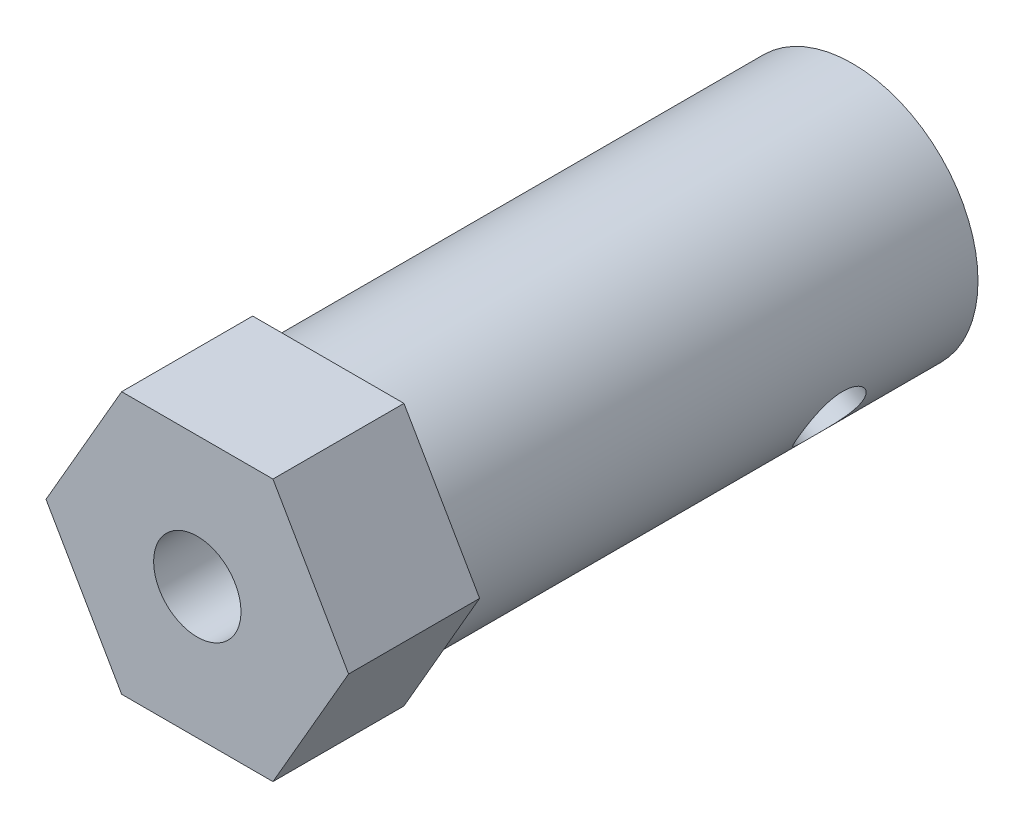
ISO-10303-21;
HEADER;
FILE_DESCRIPTION(('STEP AP214'),'2;1');
FILE_NAME('part.step','',(''),(''),'','','');
FILE_SCHEMA(('AUTOMOTIVE_DESIGN { 1 0 10303 214 1 1 1 1 }'));
ENDSEC;
DATA;
#1=APPLICATION_CONTEXT('core data for automotive mechanical design processes');
#2=APPLICATION_PROTOCOL_DEFINITION('international standard','automotive_design',2000,#1);
#3=PRODUCT_CONTEXT('',#1,'mechanical');
#4=PRODUCT('Part','Part','',(#3));
#5=PRODUCT_RELATED_PRODUCT_CATEGORY('part','',(#4));
#6=PRODUCT_DEFINITION_FORMATION('','',#4);
#7=PRODUCT_DEFINITION_CONTEXT('part definition',#1,'design');
#8=PRODUCT_DEFINITION('design','',#6,#7);
#9=PRODUCT_DEFINITION_SHAPE('','',#8);
#10=(LENGTH_UNIT() NAMED_UNIT(*) SI_UNIT(.MILLI.,.METRE.));
#11=(NAMED_UNIT(*) PLANE_ANGLE_UNIT() SI_UNIT($,.RADIAN.));
#12=(NAMED_UNIT(*) SI_UNIT($,.STERADIAN.) SOLID_ANGLE_UNIT());
#13=UNCERTAINTY_MEASURE_WITH_UNIT(LENGTH_MEASURE(1.E-05),#10,'distance_accuracy_value','');
#14=(GEOMETRIC_REPRESENTATION_CONTEXT(3) GLOBAL_UNCERTAINTY_ASSIGNED_CONTEXT((#13)) GLOBAL_UNIT_ASSIGNED_CONTEXT((#10,
#11,#12)) REPRESENTATION_CONTEXT('',''));
#15=CARTESIAN_POINT('',(0.,0.,0.));
#16=DIRECTION('',(0.,0.,1.));
#17=DIRECTION('',(1.,0.,0.));
#18=AXIS2_PLACEMENT_3D('',#15,#16,#17);
#19=CARTESIAN_POINT('',(-3.46410161513783,5.99999999999996,6.));
#20=DIRECTION('',(0.866025403784441,-0.499999999999995,0.));
#21=DIRECTION('',(0.499999999999995,0.866025403784442,0.));
#22=AXIS2_PLACEMENT_3D('',#19,#20,#21);
#23=PLANE('',#22);
#24=DIRECTION('',(-0.499999999999995,-0.866025403784441,0.));
#25=VECTOR('',#24,1.);
#26=CARTESIAN_POINT('',(-3.46410161513783,5.99999999999996,0.));
#27=LINE('',#26,#25);
#28=CARTESIAN_POINT('',(-3.46410161513783,5.99999999999996,0.));
#29=VERTEX_POINT('',#28);
#30=CARTESIAN_POINT('',(-6.92820323027551,0.,0.));
#31=VERTEX_POINT('',#30);
#32=EDGE_CURVE('E135',#29,#31,#27,.T.);
#33=ORIENTED_EDGE('',*,*,#32,.T.);
#34=DIRECTION('',(0.,0.,-1.));
#35=VECTOR('',#34,1.);
#36=CARTESIAN_POINT('',(-6.92820323027551,0.,6.));
#37=LINE('',#36,#35);
#38=CARTESIAN_POINT('',(-6.92820323027551,0.,6.));
#39=VERTEX_POINT('',#38);
#40=EDGE_CURVE('E57',#39,#31,#37,.T.);
#41=ORIENTED_EDGE('',*,*,#40,.F.);
#42=DIRECTION('',(-0.499999999999995,-0.866025403784441,0.));
#43=VECTOR('',#42,1.);
#44=CARTESIAN_POINT('',(-3.46410161513783,5.99999999999996,6.));
#45=LINE('',#44,#43);
#46=CARTESIAN_POINT('',(-3.46410161513783,5.99999999999996,6.));
#47=VERTEX_POINT('',#46);
#48=EDGE_CURVE('E146',#47,#39,#45,.T.);
#49=ORIENTED_EDGE('',*,*,#48,.F.);
#50=DIRECTION('',(0.,0.,-1.));
#51=VECTOR('',#50,1.);
#52=CARTESIAN_POINT('',(-3.46410161513783,5.99999999999996,6.));
#53=LINE('',#52,#51);
#54=EDGE_CURVE('E131',#47,#29,#53,.T.);
#55=ORIENTED_EDGE('',*,*,#54,.T.);
#56=EDGE_LOOP('',(#33,#41,#49,#55));
#57=FACE_BOUND('',#56,.T.);
#58=ADVANCED_FACE('F43',(#57),#23,.F.);
#59=CARTESIAN_POINT('',(-6.92820323027551,0.,6.));
#60=DIRECTION('',(0.866025403784438,0.500000000000001,0.));
#61=DIRECTION('',(-0.500000000000001,0.866025403784438,0.));
#62=AXIS2_PLACEMENT_3D('',#59,#60,#61);
#63=PLANE('',#62);
#64=DIRECTION('',(0.500000000000001,-0.866025403784438,0.));
#65=VECTOR('',#64,1.);
#66=CARTESIAN_POINT('',(-6.92820323027551,0.,0.));
#67=LINE('',#66,#65);
#68=CARTESIAN_POINT('',(-3.46410161513774,-6.00000000000001,0.));
#69=VERTEX_POINT('',#68);
#70=EDGE_CURVE('E138',#31,#69,#67,.T.);
#71=ORIENTED_EDGE('',*,*,#70,.T.);
#72=DIRECTION('',(0.,0.,-1.));
#73=VECTOR('',#72,1.);
#74=CARTESIAN_POINT('',(-3.46410161513774,-6.00000000000001,6.));
#75=LINE('',#74,#73);
#76=CARTESIAN_POINT('',(-3.46410161513774,-6.00000000000001,6.));
#77=VERTEX_POINT('',#76);
#78=EDGE_CURVE('E150',#77,#69,#75,.T.);
#79=ORIENTED_EDGE('',*,*,#78,.F.);
#80=DIRECTION('',(0.500000000000001,-0.866025403784438,0.));
#81=VECTOR('',#80,1.);
#82=CARTESIAN_POINT('',(-6.92820323027551,0.,6.));
#83=LINE('',#82,#81);
#84=EDGE_CURVE('E104',#39,#77,#83,.T.);
#85=ORIENTED_EDGE('',*,*,#84,.F.);
#86=ORIENTED_EDGE('',*,*,#40,.T.);
#87=EDGE_LOOP('',(#71,#79,#85,#86));
#88=FACE_BOUND('',#87,.T.);
#89=ADVANCED_FACE('F153',(#88),#63,.F.);
#90=CARTESIAN_POINT('',(-3.46410161513774,-6.00000000000001,6.));
#91=DIRECTION('',(0.,1.,0.));
#92=DIRECTION('',(-1.,0.,0.));
#93=AXIS2_PLACEMENT_3D('',#90,#91,#92);
#94=PLANE('',#93);
#95=DIRECTION('',(1.,0.,0.));
#96=VECTOR('',#95,1.);
#97=CARTESIAN_POINT('',(-3.46410161513774,-6.00000000000001,0.));
#98=LINE('',#97,#96);
#99=CARTESIAN_POINT('',(3.46410161513778,-5.99999999999999,0.));
#100=VERTEX_POINT('',#99);
#101=EDGE_CURVE('E141',#69,#100,#98,.T.);
#102=ORIENTED_EDGE('',*,*,#101,.T.);
#103=DIRECTION('',(0.,0.,-1.));
#104=VECTOR('',#103,1.);
#105=CARTESIAN_POINT('',(3.46410161513778,-5.99999999999999,6.));
#106=LINE('',#105,#104);
#107=CARTESIAN_POINT('',(3.46410161513778,-5.99999999999999,6.));
#108=VERTEX_POINT('',#107);
#109=EDGE_CURVE('E126',#108,#100,#106,.T.);
#110=ORIENTED_EDGE('',*,*,#109,.F.);
#111=DIRECTION('',(1.,0.,0.));
#112=VECTOR('',#111,1.);
#113=CARTESIAN_POINT('',(-3.46410161513774,-6.00000000000001,6.));
#114=LINE('',#113,#112);
#115=EDGE_CURVE('E117',#77,#108,#114,.T.);
#116=ORIENTED_EDGE('',*,*,#115,.F.);
#117=ORIENTED_EDGE('',*,*,#78,.T.);
#118=EDGE_LOOP('',(#102,#110,#116,#117));
#119=FACE_BOUND('',#118,.T.);
#120=ADVANCED_FACE('F161',(#119),#94,.F.);
#121=CARTESIAN_POINT('',(3.46410161513778,-5.99999999999999,6.));
#122=DIRECTION('',(-0.866025403784442,0.499999999999995,0.));
#123=DIRECTION('',(-0.499999999999995,-0.866025403784442,0.));
#124=AXIS2_PLACEMENT_3D('',#121,#122,#123);
#125=PLANE('',#124);
#126=DIRECTION('',(0.499999999999995,0.866025403784441,0.));
#127=VECTOR('',#126,1.);
#128=CARTESIAN_POINT('',(3.46410161513778,-5.99999999999999,0.));
#129=LINE('',#128,#127);
#130=CARTESIAN_POINT('',(6.92820323027551,0.,0.));
#131=VERTEX_POINT('',#130);
#132=EDGE_CURVE('E125',#100,#131,#129,.T.);
#133=ORIENTED_EDGE('',*,*,#132,.T.);
#134=DIRECTION('',(0.,0.,-1.));
#135=VECTOR('',#134,1.);
#136=CARTESIAN_POINT('',(6.92820323027551,0.,6.));
#137=LINE('',#136,#135);
#138=CARTESIAN_POINT('',(6.92820323027551,0.,6.));
#139=VERTEX_POINT('',#138);
#140=EDGE_CURVE('E122',#139,#131,#137,.T.);
#141=ORIENTED_EDGE('',*,*,#140,.F.);
#142=DIRECTION('',(0.499999999999995,0.866025403784441,0.));
#143=VECTOR('',#142,1.);
#144=CARTESIAN_POINT('',(3.46410161513778,-5.99999999999999,6.));
#145=LINE('',#144,#143);
#146=EDGE_CURVE('E111',#108,#139,#145,.T.);
#147=ORIENTED_EDGE('',*,*,#146,.F.);
#148=ORIENTED_EDGE('',*,*,#109,.T.);
#149=EDGE_LOOP('',(#133,#141,#147,#148));
#150=FACE_BOUND('',#149,.T.);
#151=ADVANCED_FACE('F123',(#150),#125,.F.);
#152=CARTESIAN_POINT('',(6.92820323027551,0.,6.));
#153=DIRECTION('',(-0.866025403784434,-0.500000000000007,0.));
#154=DIRECTION('',(0.500000000000007,-0.866025403784435,0.));
#155=AXIS2_PLACEMENT_3D('',#152,#153,#154);
#156=PLANE('',#155);
#157=DIRECTION('',(-0.500000000000007,0.866025403784434,0.));
#158=VECTOR('',#157,1.);
#159=CARTESIAN_POINT('',(6.92820323027551,0.,0.));
#160=LINE('',#159,#158);
#161=CARTESIAN_POINT('',(3.4641016151377,6.00000000000003,0.));
#162=VERTEX_POINT('',#161);
#163=EDGE_CURVE('E89',#131,#162,#160,.T.);
#164=ORIENTED_EDGE('',*,*,#163,.T.);
#165=DIRECTION('',(0.,0.,-1.));
#166=VECTOR('',#165,1.);
#167=CARTESIAN_POINT('',(3.4641016151377,6.00000000000003,6.));
#168=LINE('',#167,#166);
#169=CARTESIAN_POINT('',(3.4641016151377,6.00000000000003,6.));
#170=VERTEX_POINT('',#169);
#171=EDGE_CURVE('E127',#170,#162,#168,.T.);
#172=ORIENTED_EDGE('',*,*,#171,.F.);
#173=DIRECTION('',(-0.500000000000007,0.866025403784434,0.));
#174=VECTOR('',#173,1.);
#175=CARTESIAN_POINT('',(6.92820323027551,0.,6.));
#176=LINE('',#175,#174);
#177=EDGE_CURVE('E115',#139,#170,#176,.T.);
#178=ORIENTED_EDGE('',*,*,#177,.F.);
#179=ORIENTED_EDGE('',*,*,#140,.T.);
#180=EDGE_LOOP('',(#164,#172,#178,#179));
#181=FACE_BOUND('',#180,.T.);
#182=ADVANCED_FACE('F129',(#181),#156,.F.);
#183=CARTESIAN_POINT('',(3.4641016151377,6.00000000000003,6.));
#184=DIRECTION('',(0.,-1.,0.));
#185=DIRECTION('',(1.,0.,0.));
#186=AXIS2_PLACEMENT_3D('',#183,#184,#185);
#187=PLANE('',#186);
#188=DIRECTION('',(-1.,0.,0.));
#189=VECTOR('',#188,1.);
#190=CARTESIAN_POINT('',(3.4641016151377,6.00000000000003,0.));
#191=LINE('',#190,#189);
#192=EDGE_CURVE('E95',#162,#29,#191,.T.);
#193=ORIENTED_EDGE('',*,*,#192,.T.);
#194=ORIENTED_EDGE('',*,*,#54,.F.);
#195=DIRECTION('',(-1.,0.,0.));
#196=VECTOR('',#195,1.);
#197=CARTESIAN_POINT('',(3.4641016151377,6.00000000000003,6.));
#198=LINE('',#197,#196);
#199=EDGE_CURVE('E66',#170,#47,#198,.T.);
#200=ORIENTED_EDGE('',*,*,#199,.F.);
#201=ORIENTED_EDGE('',*,*,#171,.T.);
#202=EDGE_LOOP('',(#193,#194,#200,#201));
#203=FACE_BOUND('',#202,.T.);
#204=ADVANCED_FACE('F215',(#203),#187,.F.);
#205=CARTESIAN_POINT('',(0.,0.,6.));
#206=DIRECTION('',(0.,0.,1.));
#207=DIRECTION('',(1.,0.,0.));
#208=AXIS2_PLACEMENT_3D('',#205,#206,#207);
#209=PLANE('',#208);
#210=CARTESIAN_POINT('',(0.,0.,6.));
#211=DIRECTION('',(0.,0.,-1.));
#212=DIRECTION('',(-1.,0.,0.));
#213=AXIS2_PLACEMENT_3D('',#210,#211,#212);
#214=CIRCLE('',#213,2.);
#215=CARTESIAN_POINT('',(-2.,0.,6.));
#216=VERTEX_POINT('',#215);
#217=EDGE_CURVE('E167',#216,#216,#214,.T.);
#218=ORIENTED_EDGE('',*,*,#217,.T.);
#219=EDGE_LOOP('',(#218));
#220=FACE_BOUND('',#219,.T.);
#221=ORIENTED_EDGE('',*,*,#48,.T.);
#222=ORIENTED_EDGE('',*,*,#84,.T.);
#223=ORIENTED_EDGE('',*,*,#115,.T.);
#224=ORIENTED_EDGE('',*,*,#146,.T.);
#225=ORIENTED_EDGE('',*,*,#177,.T.);
#226=ORIENTED_EDGE('',*,*,#199,.T.);
#227=EDGE_LOOP('',(#221,#222,#223,#224,#225,#226));
#228=FACE_BOUND('',#227,.T.);
#229=ADVANCED_FACE('F113',(#220,#228),#209,.T.);
#230=CARTESIAN_POINT('',(0.,0.,0.));
#231=DIRECTION('',(0.,0.,1.));
#232=DIRECTION('',(1.,0.,0.));
#233=AXIS2_PLACEMENT_3D('',#230,#231,#232);
#234=PLANE('',#233);
#235=CARTESIAN_POINT('',(0.,0.,0.));
#236=DIRECTION('',(0.,0.,-1.));
#237=DIRECTION('',(-1.,0.,0.));
#238=AXIS2_PLACEMENT_3D('',#235,#236,#237);
#239=CIRCLE('',#238,5.75);
#240=CARTESIAN_POINT('',(-5.75,0.,0.));
#241=VERTEX_POINT('',#240);
#242=EDGE_CURVE('E11',#241,#241,#239,.T.);
#243=ORIENTED_EDGE('',*,*,#242,.F.);
#244=EDGE_LOOP('',(#243));
#245=FACE_BOUND('',#244,.T.);
#246=ORIENTED_EDGE('',*,*,#32,.F.);
#247=ORIENTED_EDGE('',*,*,#192,.F.);
#248=ORIENTED_EDGE('',*,*,#163,.F.);
#249=ORIENTED_EDGE('',*,*,#132,.F.);
#250=ORIENTED_EDGE('',*,*,#101,.F.);
#251=ORIENTED_EDGE('',*,*,#70,.F.);
#252=EDGE_LOOP('',(#246,#247,#248,#249,#250,#251));
#253=FACE_BOUND('',#252,.T.);
#254=ADVANCED_FACE('F158',(#245,#253),#234,.F.);
#255=CARTESIAN_POINT('',(0.,0.,-24.));
#256=DIRECTION('',(0.,0.,1.));
#257=DIRECTION('',(1.,0.,0.));
#258=AXIS2_PLACEMENT_3D('',#255,#256,#257);
#259=CYLINDRICAL_SURFACE('',#258,5.75);
#260=CARTESIAN_POINT('',(5.55722113075736,-1.47641230822012,-18.));
#261=CARTESIAN_POINT('',(5.55722136071016,-1.47641489598219,-18.0827025118796));
#262=CARTESIAN_POINT('',(5.55540776706454,-1.48329007948835,-18.1654278772811));
#263=CARTESIAN_POINT('',(5.54807553473378,-1.51047987820257,-18.328494285914));
#264=CARTESIAN_POINT('',(5.54255493246361,-1.53080161590377,-18.4088340419363));
#265=CARTESIAN_POINT('',(5.52760134616089,-1.58394395701895,-18.5647468235353));
#266=CARTESIAN_POINT('',(5.51817370147193,-1.61674749787789,-18.6403261928731));
#267=CARTESIAN_POINT('',(5.49509515344553,-1.69352577324471,-18.7848659142589));
#268=CARTESIAN_POINT('',(5.48144397417512,-1.73750123760575,-18.8538258334577));
#269=CARTESIAN_POINT('',(5.44922524142547,-1.83607840051586,-18.9848203400384));
#270=CARTESIAN_POINT('',(5.43055778730774,-1.89088926191198,-19.0466729921918));
#271=CARTESIAN_POINT('',(5.38812936910053,-2.0085989367878,-19.1600908276964));
#272=CARTESIAN_POINT('',(5.36436789625488,-2.07149855786688,-19.2116549825083));
#273=CARTESIAN_POINT('',(5.31117832236998,-2.20433046836102,-19.3037856975123));
#274=CARTESIAN_POINT('',(5.28166917074583,-2.27435554396496,-19.3441721440468));
#275=CARTESIAN_POINT('',(5.21734054730939,-2.41827644085031,-19.4116276367408));
#276=CARTESIAN_POINT('',(5.18252193222295,-2.49217163639514,-19.4386988284544));
#277=CARTESIAN_POINT('',(5.10890534133279,-2.63974107934647,-19.4781686910732));
#278=CARTESIAN_POINT('',(5.07021160293842,-2.71338451067179,-19.4908766617071));
#279=CARTESIAN_POINT('',(4.98914035484316,-2.8597150031523,-19.5022316687055));
#280=CARTESIAN_POINT('',(4.94676343726796,-2.93240221587847,-19.5008809610801));
#281=CARTESIAN_POINT('',(4.86067756766856,-3.07293746674693,-19.4843764114755));
#282=CARTESIAN_POINT('',(4.81702548141221,-3.14085997104418,-19.4695566289211));
#283=CARTESIAN_POINT('',(4.72892558823583,-3.27200352174088,-19.4270733267933));
#284=CARTESIAN_POINT('',(4.68447773708927,-3.33522430581835,-19.3994090912151));
#285=CARTESIAN_POINT('',(4.59600500303769,-3.45614085391043,-19.3317611105538));
#286=CARTESIAN_POINT('',(4.55198830983483,-3.51377757775231,-19.2916613442095));
#287=CARTESIAN_POINT('',(4.46656720195115,-3.62174318001789,-19.2003692607206));
#288=CARTESIAN_POINT('',(4.42516327919811,-3.67207068458241,-19.1491748626962));
#289=CARTESIAN_POINT('',(4.34556760565659,-3.7659588427232,-19.0353671462552));
#290=CARTESIAN_POINT('',(4.30750615214473,-3.80927692660276,-18.9724622554754));
#291=CARTESIAN_POINT('',(4.23785578042895,-3.8866173972475,-18.8379452148636));
#292=CARTESIAN_POINT('',(4.20626722266665,-3.92063926639042,-18.7663325804967));
#293=CARTESIAN_POINT('',(4.1510923893375,-3.97901518520282,-18.6158563577676));
#294=CARTESIAN_POINT('',(4.12755259364875,-4.00331321465999,-18.5369538883825));
#295=CARTESIAN_POINT('',(4.090138880542,-4.04153276606443,-18.3744844829647));
#296=CARTESIAN_POINT('',(4.0762626840089,-4.05545673474001,-18.2909186517895));
#297=CARTESIAN_POINT('',(4.05931325975991,-4.07242147034947,-18.1240609452585));
#298=CARTESIAN_POINT('',(4.0559418618996,-4.07576266731435,-18.0408298385871));
#299=CARTESIAN_POINT('',(4.05937152111611,-4.07234685151389,-17.874791704668));
#300=CARTESIAN_POINT('',(4.06617154812631,-4.06559086129712,-17.7919846353299));
#301=CARTESIAN_POINT('',(4.08929757745671,-4.04232648260581,-17.6307016559855));
#302=CARTESIAN_POINT('',(4.10544809988444,-4.02599767699227,-17.5521743674906));
#303=CARTESIAN_POINT('',(4.14620349249303,-3.98401143692444,-17.3999598290562));
#304=CARTESIAN_POINT('',(4.1708094311122,-3.95835282351865,-17.3262731921906));
#305=CARTESIAN_POINT('',(4.22777189799078,-3.89746235669493,-17.1841116303205));
#306=CARTESIAN_POINT('',(4.2602813513885,-3.86203949812469,-17.1157799033486));
#307=CARTESIAN_POINT('',(4.3311384002766,-3.78240336253314,-16.9878114474233));
#308=CARTESIAN_POINT('',(4.36948704402818,-3.73818850672095,-16.9281762834622));
#309=CARTESIAN_POINT('',(4.45138754174426,-3.64030552024394,-16.8176094483759));
#310=CARTESIAN_POINT('',(4.49505352262524,-3.5864107716838,-16.7669623765694));
#311=CARTESIAN_POINT('',(4.58474574264704,-3.47101406352671,-16.6778887151307));
#312=CARTESIAN_POINT('',(4.63077185645956,-3.40951250762377,-16.639461477377));
#313=CARTESIAN_POINT('',(4.72289476696002,-3.28069833721807,-16.5762649912451));
#314=CARTESIAN_POINT('',(4.76898840829988,-3.21343308512531,-16.5513948481437));
#315=CARTESIAN_POINT('',(4.85978523879196,-3.07438991312508,-16.5157219058226));
#316=CARTESIAN_POINT('',(4.90448871991868,-3.00261295050913,-16.5049161329262));
#317=CARTESIAN_POINT('',(4.98966950541398,-2.85875540689107,-16.4978582656111));
#318=CARTESIAN_POINT('',(5.0302323975609,-2.78674573137666,-16.5011878239951));
#319=CARTESIAN_POINT('',(5.10746567709305,-2.64253393975375,-16.5213394073171));
#320=CARTESIAN_POINT('',(5.14413619951267,-2.57033183041033,-16.5381609640163));
#321=CARTESIAN_POINT('',(5.21263698300613,-2.42839294863188,-16.5845866777533));
#322=CARTESIAN_POINT('',(5.24449642665121,-2.35864345904263,-16.6141092081108));
#323=CARTESIAN_POINT('',(5.30331713657454,-2.22323705430391,-16.6850256400347));
#324=CARTESIAN_POINT('',(5.33027773862,-2.15758069493265,-16.7264211494965));
#325=CARTESIAN_POINT('',(5.37989987925112,-2.03074816512123,-16.8211511060026));
#326=CARTESIAN_POINT('',(5.40243300755437,-1.96973066277838,-16.8747652445582));
#327=CARTESIAN_POINT('',(5.44252151759536,-1.85609752882473,-16.9918756389475));
#328=CARTESIAN_POINT('',(5.46007560580036,-1.80348408209869,-17.0553744561532));
#329=CARTESIAN_POINT('',(5.49085193822908,-1.70752535479361,-17.1920402595224));
#330=CARTESIAN_POINT('',(5.50397654142989,-1.66439548816295,-17.2653807938219));
#331=CARTESIAN_POINT('',(5.525759730213,-1.59058804468881,-17.4186604878402));
#332=CARTESIAN_POINT('',(5.53442135588035,-1.55990199442577,-17.4985951126335));
#333=CARTESIAN_POINT('',(5.54647206684565,-1.51643034957237,-17.6485762864125));
#334=CARTESIAN_POINT('',(5.55051320500374,-1.50146914084626,-17.7179478254287));
#335=CARTESIAN_POINT('',(5.55588749873707,-1.48145952205819,-17.8582074149736));
#336=CARTESIAN_POINT('',(5.55722093360818,-1.47641008961192,-17.9290953083301));
#337=CARTESIAN_POINT('',(5.55722113075736,-1.47641230822012,-18.));
#338=B_SPLINE_CURVE_WITH_KNOTS('',3,(#260,#261,#262,#263,#264,#265,#266,#267,#268,#269,#270,
#271,#272,#273,#274,#275,#276,#277,#278,#279,#280,#281,#282,#283,#284,#285,#286,#287,#288,#289,
#290,#291,#292,#293,#294,#295,#296,#297,#298,#299,#300,#301,#302,#303,#304,#305,#306,#307,#308,
#309,#310,#311,#312,#313,#314,#315,#316,#317,#318,#319,#320,#321,#322,#323,#324,#325,#326,#327,
#328,#329,#330,#331,#332,#333,#334,#335,#336,#337),.UNSPECIFIED.,.T.,.F.,(4,2,2,2,2,2,2,2,2,2,2,
2,2,2,2,2,2,2,2,2,2,2,2,2,2,2,2,2,2,2,2,2,2,2,2,2,2,2,4),(0.,0.24784693221347,0.495825251450722,
0.743465796519596,0.991122523916575,1.24413298994995,1.49716873674028,1.75407149955016,
2.01093285275295,2.26215074877579,2.51332833223609,2.75844131790607,3.00356796886319,
3.25105414713942,3.49858678350027,3.75340001453818,4.00822743093465,4.26450250455337,
4.52071711639577,4.76958977198248,5.01843722578486,5.26275935549397,5.50711236945145,
5.75663370302619,6.00619988401493,6.26263234557327,6.51905120407022,6.77353474031641,
7.02796446151303,7.27491743805458,7.52186184448271,7.76724235555625,8.01265611292846,
8.26438206043911,8.51617334546957,8.77319910700255,9.03004955584013,9.24256212496342,
9.45505277259351),.UNSPECIFIED.);
#339=CARTESIAN_POINT('',(5.55722113075736,-1.47641230822012,-18.));
#340=VERTEX_POINT('',#339);
#341=EDGE_CURVE('E171',#340,#340,#338,.T.);
#342=ORIENTED_EDGE('',*,*,#341,.T.);
#343=EDGE_LOOP('',(#342));
#344=FACE_BOUND('',#343,.T.);
#345=CARTESIAN_POINT('',(0.,0.,-24.));
#346=DIRECTION('',(0.,0.,-1.));
#347=DIRECTION('',(-1.,0.,0.));
#348=AXIS2_PLACEMENT_3D('',#345,#346,#347);
#349=CIRCLE('',#348,5.75);
#350=CARTESIAN_POINT('',(-5.75,0.,-24.));
#351=VERTEX_POINT('',#350);
#352=EDGE_CURVE('E139',#351,#351,#349,.T.);
#353=ORIENTED_EDGE('',*,*,#352,.F.);
#354=EDGE_LOOP('',(#353));
#355=FACE_BOUND('',#354,.T.);
#356=ORIENTED_EDGE('',*,*,#242,.T.);
#357=EDGE_LOOP('',(#356));
#358=FACE_BOUND('',#357,.T.);
#359=ADVANCED_FACE('F179',(#344,#355,#358),#259,.T.);
#360=CARTESIAN_POINT('',(0.,0.,-24.));
#361=DIRECTION('',(0.,0.,-1.));
#362=DIRECTION('',(-1.,0.,0.));
#363=AXIS2_PLACEMENT_3D('',#360,#361,#362);
#364=PLANE('',#363);
#365=CARTESIAN_POINT('',(0.,0.,-24.));
#366=DIRECTION('',(0.,0.,-1.));
#367=DIRECTION('',(-1.,0.,0.));
#368=AXIS2_PLACEMENT_3D('',#365,#366,#367);
#369=CIRCLE('',#368,2.);
#370=CARTESIAN_POINT('',(-2.,0.,-24.));
#371=VERTEX_POINT('',#370);
#372=EDGE_CURVE('E168',#371,#371,#369,.T.);
#373=ORIENTED_EDGE('',*,*,#372,.F.);
#374=EDGE_LOOP('',(#373));
#375=FACE_BOUND('',#374,.T.);
#376=ORIENTED_EDGE('',*,*,#352,.T.);
#377=EDGE_LOOP('',(#376));
#378=FACE_BOUND('',#377,.T.);
#379=ADVANCED_FACE('F191',(#375,#378),#364,.T.);
#380=CARTESIAN_POINT('',(0.,0.,6.));
#381=DIRECTION('',(0.,0.,-1.));
#382=DIRECTION('',(-1.,0.,0.));
#383=AXIS2_PLACEMENT_3D('',#380,#381,#382);
#384=CYLINDRICAL_SURFACE('',#383,2.);
#385=CARTESIAN_POINT('',(1.89564392373896,0.637600277910523,-18.));
#386=CARTESIAN_POINT('',(1.89565408748977,0.637585392226019,-17.9300025765744));
#387=CARTESIAN_POINT('',(1.89809043080659,0.630461731209005,-17.8599541656881));
#388=CARTESIAN_POINT('',(1.90694493610832,0.603112635919793,-17.7226701437905));
#389=CARTESIAN_POINT('',(1.91337496438087,0.582848148864565,-17.6554435549805));
#390=CARTESIAN_POINT('',(1.92810346331423,0.532070602372365,-17.5264201532616));
#391=CARTESIAN_POINT('',(1.9363749313233,0.501702798658394,-17.4645612232375));
#392=CARTESIAN_POINT('',(1.9529234442087,0.432833528036545,-17.3456545455548));
#393=CARTESIAN_POINT('',(1.96120048829051,0.39433304424943,-17.2886062175308));
#394=CARTESIAN_POINT('',(1.97773475424673,0.301990819027161,-17.1678872036834));
#395=CARTESIAN_POINT('',(1.98562473025925,0.246624837378537,-17.1053320657735));
#396=CARTESIAN_POINT('',(1.99678356754875,0.128107308785521,-16.9874745337577));
#397=CARTESIAN_POINT('',(2.000045557029,0.0649443354291098,-16.9321830351797));
#398=CARTESIAN_POINT('',(1.99994409142852,-0.0812468700736253,-16.8191412613445));
#399=CARTESIAN_POINT('',(1.99509185976308,-0.16569795771843,-16.7631940332801));
#400=CARTESIAN_POINT('',(1.97270771920409,-0.340826196887823,-16.6653777917172));
#401=CARTESIAN_POINT('',(1.95520591099417,-0.431488106501221,-16.6234757025312));
#402=CARTESIAN_POINT('',(1.91298074093011,-0.587305342613247,-16.5667923140971));
#403=CARTESIAN_POINT('',(1.89202742708328,-0.65190658539806,-16.5476429040215));
#404=CARTESIAN_POINT('',(1.84275156522514,-0.78037338205408,-16.5186098840033));
#405=CARTESIAN_POINT('',(1.81443544704665,-0.844239527308518,-16.5087182238933));
#406=CARTESIAN_POINT('',(1.75077468959898,-0.969396796570662,-16.4987782661375));
#407=CARTESIAN_POINT('',(1.71541202495333,-1.03068081801613,-16.4987555456236));
#408=CARTESIAN_POINT('',(1.63879999349243,-1.14859927788888,-16.5086179367803));
#409=CARTESIAN_POINT('',(1.59754926533105,-1.20523263627904,-16.5185053429081));
#410=CARTESIAN_POINT('',(1.51222065234838,-1.31058455676589,-16.5470810505899));
#411=CARTESIAN_POINT('',(1.46828798526321,-1.35950776469479,-16.5654563263871));
#412=CARTESIAN_POINT('',(1.37790903600702,-1.45103711456792,-16.6099956421822));
#413=CARTESIAN_POINT('',(1.33146220755323,-1.49364187604387,-16.6361613805132));
#414=CARTESIAN_POINT('',(1.23239733682158,-1.57664611720255,-16.6985296151453));
#415=CARTESIAN_POINT('',(1.17965563227528,-1.61630732162638,-16.7355120966188));
#416=CARTESIAN_POINT('',(1.07457113996937,-1.68800223890063,-16.8167337039705));
#417=CARTESIAN_POINT('',(1.02222873227807,-1.72002939434674,-16.8609790136999));
#418=CARTESIAN_POINT('',(0.909461642408373,-1.78264154526087,-16.9652233488209));
#419=CARTESIAN_POINT('',(0.849472575511648,-1.81170345690481,-17.0266092100264));
#420=CARTESIAN_POINT('',(0.73528223528092,-1.86097297626604,-17.1578345836219));
#421=CARTESIAN_POINT('',(0.681083725991977,-1.88117636964406,-17.2276780995251));
#422=CARTESIAN_POINT('',(0.592127494785225,-1.91079361445672,-17.3609818702456));
#423=CARTESIAN_POINT('',(0.555643511488165,-1.92154920300619,-17.4229870453006));
#424=CARTESIAN_POINT('',(0.491826641358085,-1.93886609379974,-17.5520652814194));
#425=CARTESIAN_POINT('',(0.464473103722223,-1.94543689201414,-17.6191264796904));
#426=CARTESIAN_POINT('',(0.4265051152861,-1.95407248304111,-17.7436869439983));
#427=CARTESIAN_POINT('',(0.413647540168983,-1.95677223513885,-17.8004470821169));
#428=CARTESIAN_POINT('',(0.397567036428443,-1.96010546225804,-17.9153554661738));
#429=CARTESIAN_POINT('',(0.394331781273285,-1.96074158096169,-17.9735018399028));
#430=CARTESIAN_POINT('',(0.397935743729606,-1.96001244952257,-18.0894789917334));
#431=CARTESIAN_POINT('',(0.404778669514205,-1.95864646272456,-18.1473096458097));
#432=CARTESIAN_POINT('',(0.427607342520073,-1.95378673256666,-18.2610761524429));
#433=CARTESIAN_POINT('',(0.443608694536478,-1.95028935693044,-18.3170085979481));
#434=CARTESIAN_POINT('',(0.490410008887602,-1.93914011382242,-18.4463380449389));
#435=CARTESIAN_POINT('',(0.524507283729583,-1.93042320958673,-18.518435953915));
#436=CARTESIAN_POINT('',(0.602270967960614,-1.90759330516805,-18.6563076636401));
#437=CARTESIAN_POINT('',(0.645954964609417,-1.89347035143975,-18.7220695172947));
#438=CARTESIAN_POINT('',(0.741248766239042,-1.85828512333923,-18.8493490080481));
#439=CARTESIAN_POINT('',(0.793085005232819,-1.83699415313665,-18.9106328762182));
#440=CARTESIAN_POINT('',(0.900859102345447,-1.78661638972402,-19.0260020963612));
#441=CARTESIAN_POINT('',(0.956798945733176,-1.75752580485511,-19.0800839279889));
#442=CARTESIAN_POINT('',(1.08306347963633,-1.68328347791819,-19.1912769916294));
#443=CARTESIAN_POINT('',(1.1538640186322,-1.63601237801057,-19.2464752388576));
#444=CARTESIAN_POINT('',(1.29427595520156,-1.52731038197266,-19.3426207334509));
#445=CARTESIAN_POINT('',(1.36388961107557,-1.46591061874742,-19.3835988245813));
#446=CARTESIAN_POINT('',(1.47700387262091,-1.35014237769219,-19.4384379914469));
#447=CARTESIAN_POINT('',(1.52200059949121,-1.29932719312372,-19.4567567932754));
#448=CARTESIAN_POINT('',(1.60756517285095,-1.19182075592638,-19.4841287963075));
#449=CARTESIAN_POINT('',(1.64813694996999,-1.13513480695957,-19.4931902815485));
#450=CARTESIAN_POINT('',(1.72346052121869,-1.01715014675135,-19.5015163909286));
#451=CARTESIAN_POINT('',(1.75819846011135,-0.955840941675915,-19.5007580173482));
#452=CARTESIAN_POINT('',(1.8207033481814,-0.830625360315254,-19.4894390086988));
#453=CARTESIAN_POINT('',(1.84846843777298,-0.766718296476749,-19.4788757622925));
#454=CARTESIAN_POINT('',(1.89593226272871,-0.640217011748749,-19.4490250838328));
#455=CARTESIAN_POINT('',(1.91584176676155,-0.577638536564044,-19.4299998186784));
#456=CARTESIAN_POINT('',(1.94894647050619,-0.45358010335396,-19.3842119343811));
#457=CARTESIAN_POINT('',(1.96214023231773,-0.392100383298415,-19.3574476601691));
#458=CARTESIAN_POINT('',(1.98357363241055,-0.264702532323772,-19.293722062404));
#459=CARTESIAN_POINT('',(1.99108276584025,-0.199070541641537,-19.2559490686404));
#460=CARTESIAN_POINT('',(1.9997147986867,-0.0721024895415994,-19.1731335594458));
#461=CARTESIAN_POINT('',(2.00083179391228,-0.0107704514578929,-19.128084362714));
#462=CARTESIAN_POINT('',(1.99774537198576,0.118069424022798,-19.0219946334392));
#463=CARTESIAN_POINT('',(1.99244573883613,0.184398800894352,-18.9595536005601));
#464=CARTESIAN_POINT('',(1.97721613716281,0.307317157844424,-18.8261319281001));
#465=CARTESIAN_POINT('',(1.96728447604931,0.363902567021096,-18.7551481739634));
#466=CARTESIAN_POINT('',(1.948306507184,0.453573830174071,-18.6211167494097));
#467=CARTESIAN_POINT('',(1.93953208214806,0.489095609037574,-18.5596650172934));
#468=CARTESIAN_POINT('',(1.92308431955569,0.550228455684845,-18.4319170869441));
#469=CARTESIAN_POINT('',(1.91540809509365,0.575865819937025,-18.3656343084046));
#470=CARTESIAN_POINT('',(1.90507025160778,0.609030000107484,-18.2492117804031));
#471=CARTESIAN_POINT('',(1.901598338128,0.619662331912667,-18.2000329287095));
#472=CARTESIAN_POINT('',(1.89688225311123,0.633950530515307,-18.1005776669663));
#473=CARTESIAN_POINT('',(1.89563661979891,0.637610975156954,-18.0503019990563));
#474=CARTESIAN_POINT('',(1.89564392373896,0.637600277910523,-18.));
#475=B_SPLINE_CURVE_WITH_KNOTS('',3,(#385,#386,#387,#388,#389,#390,#391,#392,#393,#394,#395,
#396,#397,#398,#399,#400,#401,#402,#403,#404,#405,#406,#407,#408,#409,#410,#411,#412,#413,#414,
#415,#416,#417,#418,#419,#420,#421,#422,#423,#424,#425,#426,#427,#428,#429,#430,#431,#432,#433,
#434,#435,#436,#437,#438,#439,#440,#441,#442,#443,#444,#445,#446,#447,#448,#449,#450,#451,#452,
#453,#454,#455,#456,#457,#458,#459,#460,#461,#462,#463,#464,#465,#466,#467,#468,#469,#470,#471,
#472,#473,#474),.UNSPECIFIED.,.T.,.F.,(4,2,2,2,2,2,2,2,2,2,2,2,2,2,2,2,2,2,2,2,2,2,2,2,2,2,2,2,
2,2,2,2,2,2,2,2,2,2,2,2,2,2,2,2,4),(0.,0.209731776684494,0.420089722582993,0.627545385620143,
0.834975984672346,1.08585208691169,1.33710031031849,1.63964848103538,1.94147907444963,
2.15227725277555,2.36289195870711,2.57405250727806,2.78526195641288,2.9892375589505,
3.19325766108669,3.41936844116894,3.64567274887663,3.91649517204701,4.18744629647933,
4.40499409477197,4.62204646613006,4.79608005545902,4.96989060538193,5.14376512326213,
5.31793678696019,5.55730028202398,5.79710662639151,6.0454320909006,6.29387849446618,
6.59652499511463,6.89851088586565,7.10852896194427,7.31835893539181,7.52868041101044,
7.73905791773945,7.94332812691912,8.14764205379333,8.37510052489611,8.60276905744645,
8.87547580578155,9.14828228208531,9.36218279640836,9.575510257727,9.72632812073767,
9.8770469203241),.UNSPECIFIED.);
#476=CARTESIAN_POINT('',(1.89564392373896,0.637600277910523,-18.));
#477=VERTEX_POINT('',#476);
#478=EDGE_CURVE('E46',#477,#477,#475,.T.);
#479=ORIENTED_EDGE('',*,*,#478,.T.);
#480=EDGE_LOOP('',(#479));
#481=FACE_BOUND('',#480,.T.);
#482=ORIENTED_EDGE('',*,*,#217,.F.);
#483=EDGE_LOOP('',(#482));
#484=FACE_BOUND('',#483,.T.);
#485=ORIENTED_EDGE('',*,*,#372,.T.);
#486=EDGE_LOOP('',(#485));
#487=FACE_BOUND('',#486,.T.);
#488=ADVANCED_FACE('F186',(#481,#484,#487),#384,.F.);
#489=CARTESIAN_POINT('',(0.,0.,-18.));
#490=DIRECTION('',(0.866025403784441,-0.499999999999995,0.));
#491=DIRECTION('',(0.499999999999995,0.866025403784441,0.));
#492=AXIS2_PLACEMENT_3D('',#489,#490,#491);
#493=CYLINDRICAL_SURFACE('',#492,1.5);
#494=ORIENTED_EDGE('',*,*,#478,.F.);
#495=EDGE_LOOP('',(#494));
#496=FACE_BOUND('',#495,.T.);
#497=ORIENTED_EDGE('',*,*,#341,.F.);
#498=EDGE_LOOP('',(#497));
#499=FACE_BOUND('',#498,.T.);
#500=ADVANCED_FACE('F183',(#496,#499),#493,.F.);
#501=CLOSED_SHELL('',(#58,#89,#120,#151,#182,#204,#229,#254,#359,#379,#488,#500));
#502=MANIFOLD_SOLID_BREP('B2',#501);
#503=ADVANCED_BREP_SHAPE_REPRESENTATION('',(#18,#502),#14);
#504=SHAPE_DEFINITION_REPRESENTATION(#9,#503);
ENDSEC;
END-ISO-10303-21;
